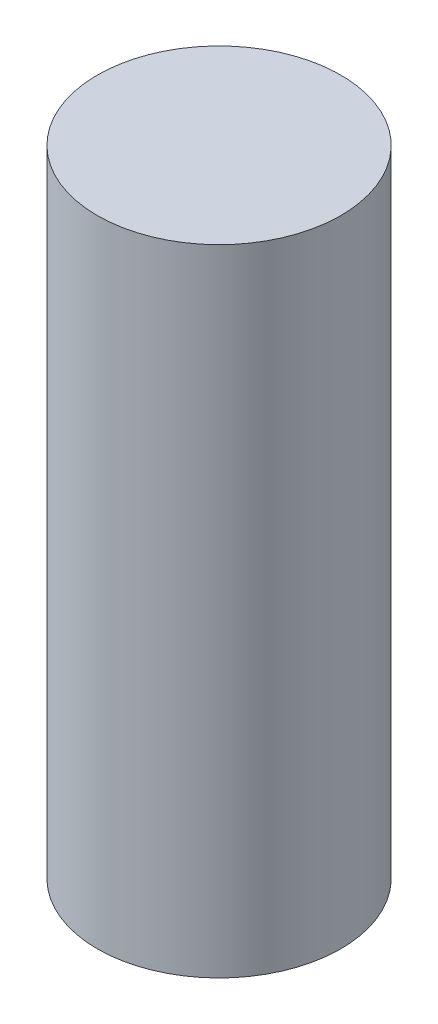
ISO-10303-21;
HEADER;
FILE_DESCRIPTION(('STEP AP214'),'2;1');
FILE_NAME('part.step','',(''),(''),'','','');
FILE_SCHEMA(('AUTOMOTIVE_DESIGN { 1 0 10303 214 1 1 1 1 }'));
ENDSEC;
DATA;
#1=APPLICATION_CONTEXT('core data for automotive mechanical design processes');
#2=APPLICATION_PROTOCOL_DEFINITION('international standard','automotive_design',2000,#1);
#3=PRODUCT_CONTEXT('',#1,'mechanical');
#4=PRODUCT('Part','Part','',(#3));
#5=PRODUCT_RELATED_PRODUCT_CATEGORY('part','',(#4));
#6=PRODUCT_DEFINITION_FORMATION('','',#4);
#7=PRODUCT_DEFINITION_CONTEXT('part definition',#1,'design');
#8=PRODUCT_DEFINITION('design','',#6,#7);
#9=PRODUCT_DEFINITION_SHAPE('','',#8);
#10=(LENGTH_UNIT() NAMED_UNIT(*) SI_UNIT(.MILLI.,.METRE.));
#11=(NAMED_UNIT(*) PLANE_ANGLE_UNIT() SI_UNIT($,.RADIAN.));
#12=(NAMED_UNIT(*) SI_UNIT($,.STERADIAN.) SOLID_ANGLE_UNIT());
#13=UNCERTAINTY_MEASURE_WITH_UNIT(LENGTH_MEASURE(1.E-05),#10,'distance_accuracy_value','');
#14=(GEOMETRIC_REPRESENTATION_CONTEXT(3) GLOBAL_UNCERTAINTY_ASSIGNED_CONTEXT((#13)) GLOBAL_UNIT_ASSIGNED_CONTEXT((#10,
#11,#12)) REPRESENTATION_CONTEXT('',''));
#15=CARTESIAN_POINT('',(0.,0.,0.));
#16=DIRECTION('',(0.,0.,1.));
#17=DIRECTION('',(1.,0.,0.));
#18=AXIS2_PLACEMENT_3D('',#15,#16,#17);
#19=CARTESIAN_POINT('',(0.,15.,0.));
#20=DIRECTION('',(0.,-1.,0.));
#21=DIRECTION('',(0.,0.,-1.));
#22=AXIS2_PLACEMENT_3D('',#19,#20,#21);
#23=CYLINDRICAL_SURFACE('',#22,2.875);
#24=CARTESIAN_POINT('',(0.,15.,0.));
#25=DIRECTION('',(0.,1.,0.));
#26=DIRECTION('',(0.,0.,1.));
#27=AXIS2_PLACEMENT_3D('',#24,#25,#26);
#28=CIRCLE('',#27,2.875);
#29=CARTESIAN_POINT('',(0.,15.,2.875));
#30=VERTEX_POINT('',#29);
#31=EDGE_CURVE('E12',#30,#30,#28,.T.);
#32=ORIENTED_EDGE('',*,*,#31,.F.);
#33=EDGE_LOOP('',(#32));
#34=FACE_BOUND('',#33,.T.);
#35=CARTESIAN_POINT('',(0.,0.,0.));
#36=DIRECTION('',(0.,1.,0.));
#37=DIRECTION('',(0.,0.,1.));
#38=AXIS2_PLACEMENT_3D('',#35,#36,#37);
#39=CIRCLE('',#38,2.875);
#40=CARTESIAN_POINT('',(0.,0.,2.875));
#41=VERTEX_POINT('',#40);
#42=EDGE_CURVE('E43',#41,#41,#39,.T.);
#43=ORIENTED_EDGE('',*,*,#42,.T.);
#44=EDGE_LOOP('',(#43));
#45=FACE_BOUND('',#44,.T.);
#46=ADVANCED_FACE('F40',(#34,#45),#23,.T.);
#47=CARTESIAN_POINT('',(0.,15.,0.));
#48=DIRECTION('',(0.,1.,0.));
#49=DIRECTION('',(0.,0.,1.));
#50=AXIS2_PLACEMENT_3D('',#47,#48,#49);
#51=PLANE('',#50);
#52=ORIENTED_EDGE('',*,*,#31,.T.);
#53=EDGE_LOOP('',(#52));
#54=FACE_BOUND('',#53,.T.);
#55=ADVANCED_FACE('F55',(#54),#51,.T.);
#56=CARTESIAN_POINT('',(0.,0.,0.));
#57=DIRECTION('',(0.,1.,0.));
#58=DIRECTION('',(0.,0.,1.));
#59=AXIS2_PLACEMENT_3D('',#56,#57,#58);
#60=PLANE('',#59);
#61=ORIENTED_EDGE('',*,*,#42,.F.);
#62=EDGE_LOOP('',(#61));
#63=FACE_BOUND('',#62,.T.);
#64=ADVANCED_FACE('F53',(#63),#60,.F.);
#65=CLOSED_SHELL('',(#46,#55,#64));
#66=MANIFOLD_SOLID_BREP('B2',#65);
#67=ADVANCED_BREP_SHAPE_REPRESENTATION('',(#18,#66),#14);
#68=SHAPE_DEFINITION_REPRESENTATION(#9,#67);
ENDSEC;
END-ISO-10303-21;
